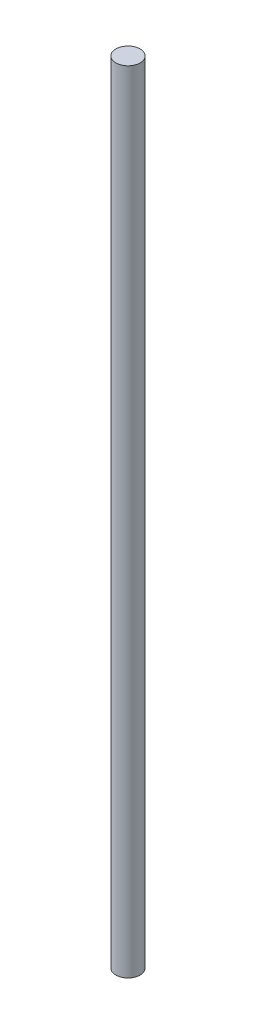
ISO-10303-21;
HEADER;
FILE_DESCRIPTION(('STEP AP214'),'2;1');
FILE_NAME('part.step','',(''),(''),'','','');
FILE_SCHEMA(('AUTOMOTIVE_DESIGN { 1 0 10303 214 1 1 1 1 }'));
ENDSEC;
DATA;
#1=APPLICATION_CONTEXT('core data for automotive mechanical design processes');
#2=APPLICATION_PROTOCOL_DEFINITION('international standard','automotive_design',2000,#1);
#3=PRODUCT_CONTEXT('',#1,'mechanical');
#4=PRODUCT('Part','Part','',(#3));
#5=PRODUCT_RELATED_PRODUCT_CATEGORY('part','',(#4));
#6=PRODUCT_DEFINITION_FORMATION('','',#4);
#7=PRODUCT_DEFINITION_CONTEXT('part definition',#1,'design');
#8=PRODUCT_DEFINITION('design','',#6,#7);
#9=PRODUCT_DEFINITION_SHAPE('','',#8);
#10=(LENGTH_UNIT() NAMED_UNIT(*) SI_UNIT(.MILLI.,.METRE.));
#11=(NAMED_UNIT(*) PLANE_ANGLE_UNIT() SI_UNIT($,.RADIAN.));
#12=(NAMED_UNIT(*) SI_UNIT($,.STERADIAN.) SOLID_ANGLE_UNIT());
#13=UNCERTAINTY_MEASURE_WITH_UNIT(LENGTH_MEASURE(1.E-05),#10,'distance_accuracy_value','');
#14=(GEOMETRIC_REPRESENTATION_CONTEXT(3) GLOBAL_UNCERTAINTY_ASSIGNED_CONTEXT((#13)) GLOBAL_UNIT_ASSIGNED_CONTEXT((#10,
#11,#12)) REPRESENTATION_CONTEXT('',''));
#15=CARTESIAN_POINT('',(0.,0.,0.));
#16=DIRECTION('',(0.,0.,1.));
#17=DIRECTION('',(1.,0.,0.));
#18=AXIS2_PLACEMENT_3D('',#15,#16,#17);
#19=CARTESIAN_POINT('',(0.,59500.978401412,0.));
#20=DIRECTION('',(0.,-1.,0.));
#21=DIRECTION('',(0.,0.,-1.));
#22=AXIS2_PLACEMENT_3D('',#19,#20,#21);
#23=CYLINDRICAL_SURFACE('',#22,914.4);
#24=CARTESIAN_POINT('',(0.,59500.978401412,0.));
#25=DIRECTION('',(0.,1.,0.));
#26=DIRECTION('',(0.,0.,1.));
#27=AXIS2_PLACEMENT_3D('',#24,#25,#26);
#28=CIRCLE('',#27,914.4);
#29=CARTESIAN_POINT('',(0.,59500.978401412,914.4));
#30=VERTEX_POINT('',#29);
#31=EDGE_CURVE('E10',#30,#30,#28,.T.);
#32=ORIENTED_EDGE('',*,*,#31,.F.);
#33=EDGE_LOOP('',(#32));
#34=FACE_BOUND('',#33,.T.);
#35=CARTESIAN_POINT('',(0.,0.,0.));
#36=DIRECTION('',(0.,1.,0.));
#37=DIRECTION('',(0.,0.,1.));
#38=AXIS2_PLACEMENT_3D('',#35,#36,#37);
#39=CIRCLE('',#38,914.4);
#40=CARTESIAN_POINT('',(0.,0.,914.4));
#41=VERTEX_POINT('',#40);
#42=EDGE_CURVE('E34',#41,#41,#39,.T.);
#43=ORIENTED_EDGE('',*,*,#42,.T.);
#44=EDGE_LOOP('',(#43));
#45=FACE_BOUND('',#44,.T.);
#46=ADVANCED_FACE('F31',(#34,#45),#23,.T.);
#47=CARTESIAN_POINT('',(0.,59500.978401412,0.));
#48=DIRECTION('',(0.,1.,0.));
#49=DIRECTION('',(0.,0.,1.));
#50=AXIS2_PLACEMENT_3D('',#47,#48,#49);
#51=PLANE('',#50);
#52=ORIENTED_EDGE('',*,*,#31,.T.);
#53=EDGE_LOOP('',(#52));
#54=FACE_BOUND('',#53,.T.);
#55=ADVANCED_FACE('F46',(#54),#51,.T.);
#56=CARTESIAN_POINT('',(0.,0.,0.));
#57=DIRECTION('',(0.,1.,0.));
#58=DIRECTION('',(0.,0.,1.));
#59=AXIS2_PLACEMENT_3D('',#56,#57,#58);
#60=PLANE('',#59);
#61=ORIENTED_EDGE('',*,*,#42,.F.);
#62=EDGE_LOOP('',(#61));
#63=FACE_BOUND('',#62,.T.);
#64=ADVANCED_FACE('F44',(#63),#60,.F.);
#65=CLOSED_SHELL('',(#46,#55,#64));
#66=MANIFOLD_SOLID_BREP('B2',#65);
#67=ADVANCED_BREP_SHAPE_REPRESENTATION('',(#18,#66),#14);
#68=SHAPE_DEFINITION_REPRESENTATION(#9,#67);
ENDSEC;
END-ISO-10303-21;
